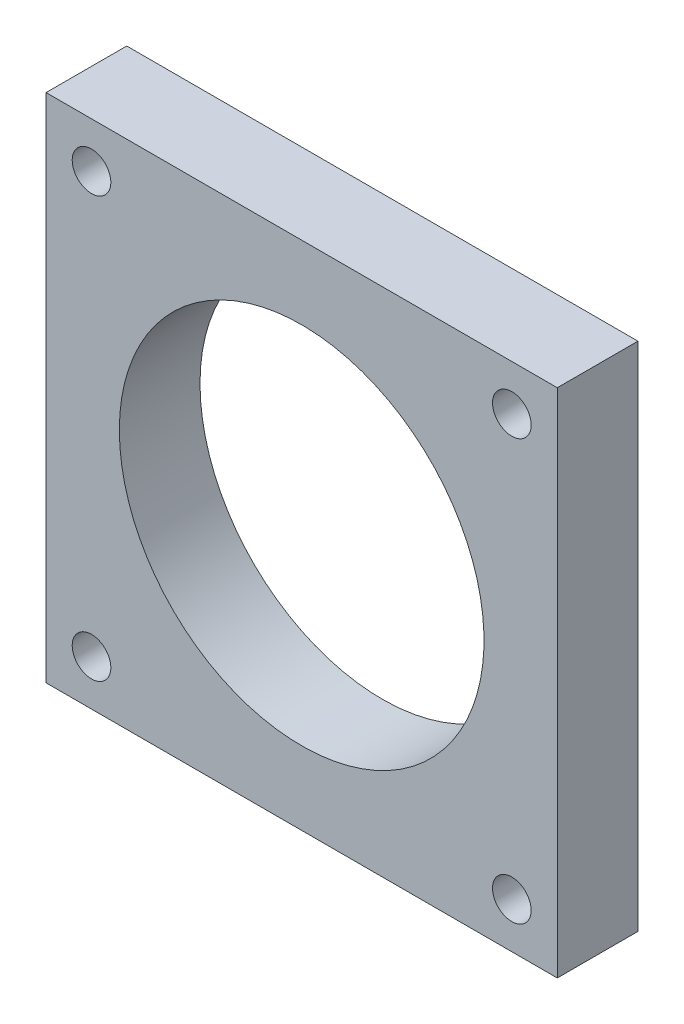
ISO-10303-21;
HEADER;
FILE_DESCRIPTION(('STEP AP214'),'2;1');
FILE_NAME('part.step','',(''),(''),'','','');
FILE_SCHEMA(('AUTOMOTIVE_DESIGN { 1 0 10303 214 1 1 1 1 }'));
ENDSEC;
DATA;
#1=APPLICATION_CONTEXT('core data for automotive mechanical design processes');
#2=APPLICATION_PROTOCOL_DEFINITION('international standard','automotive_design',2000,#1);
#3=PRODUCT_CONTEXT('',#1,'mechanical');
#4=PRODUCT('Part','Part','',(#3));
#5=PRODUCT_RELATED_PRODUCT_CATEGORY('part','',(#4));
#6=PRODUCT_DEFINITION_FORMATION('','',#4);
#7=PRODUCT_DEFINITION_CONTEXT('part definition',#1,'design');
#8=PRODUCT_DEFINITION('design','',#6,#7);
#9=PRODUCT_DEFINITION_SHAPE('','',#8);
#10=(LENGTH_UNIT() NAMED_UNIT(*) SI_UNIT(.MILLI.,.METRE.));
#11=(NAMED_UNIT(*) PLANE_ANGLE_UNIT() SI_UNIT($,.RADIAN.));
#12=(NAMED_UNIT(*) SI_UNIT($,.STERADIAN.) SOLID_ANGLE_UNIT());
#13=UNCERTAINTY_MEASURE_WITH_UNIT(LENGTH_MEASURE(1.E-05),#10,'distance_accuracy_value','');
#14=(GEOMETRIC_REPRESENTATION_CONTEXT(3) GLOBAL_UNCERTAINTY_ASSIGNED_CONTEXT((#13)) GLOBAL_UNIT_ASSIGNED_CONTEXT((#10,
#11,#12)) REPRESENTATION_CONTEXT('',''));
#15=CARTESIAN_POINT('',(0.,0.,0.));
#16=DIRECTION('',(0.,0.,1.));
#17=DIRECTION('',(1.,0.,0.));
#18=AXIS2_PLACEMENT_3D('',#15,#16,#17);
#19=CARTESIAN_POINT('',(0.,0.,7.1));
#20=DIRECTION('',(0.,0.,-1.));
#21=DIRECTION('',(-1.,0.,0.));
#22=AXIS2_PLACEMENT_3D('',#19,#20,#21);
#23=PLANE('',#22);
#24=CARTESIAN_POINT('',(18.5,18.5,7.1));
#25=DIRECTION('',(0.,0.,-1.));
#26=DIRECTION('',(-1.,0.,0.));
#27=AXIS2_PLACEMENT_3D('',#24,#25,#26);
#28=CIRCLE('',#27,1.7);
#29=CARTESIAN_POINT('',(16.8,18.5,7.1));
#30=VERTEX_POINT('',#29);
#31=EDGE_CURVE('E234',#30,#30,#28,.F.);
#32=ORIENTED_EDGE('',*,*,#31,.F.);
#33=EDGE_LOOP('',(#32));
#34=FACE_BOUND('',#33,.T.);
#35=CARTESIAN_POINT('',(-18.5,18.5,7.1));
#36=DIRECTION('',(0.,0.,-1.));
#37=DIRECTION('',(-1.,0.,0.));
#38=AXIS2_PLACEMENT_3D('',#35,#36,#37);
#39=CIRCLE('',#38,1.7);
#40=CARTESIAN_POINT('',(-20.2,18.5,7.1));
#41=VERTEX_POINT('',#40);
#42=EDGE_CURVE('E238',#41,#41,#39,.F.);
#43=ORIENTED_EDGE('',*,*,#42,.F.);
#44=EDGE_LOOP('',(#43));
#45=FACE_BOUND('',#44,.T.);
#46=CARTESIAN_POINT('',(-18.5,-18.5,7.1));
#47=DIRECTION('',(0.,0.,-1.));
#48=DIRECTION('',(-1.,0.,0.));
#49=AXIS2_PLACEMENT_3D('',#46,#47,#48);
#50=CIRCLE('',#49,1.7);
#51=CARTESIAN_POINT('',(-20.2,-18.5,7.1));
#52=VERTEX_POINT('',#51);
#53=EDGE_CURVE('E142',#52,#52,#50,.F.);
#54=ORIENTED_EDGE('',*,*,#53,.F.);
#55=EDGE_LOOP('',(#54));
#56=FACE_BOUND('',#55,.T.);
#57=CARTESIAN_POINT('',(18.5,-18.5,7.1));
#58=DIRECTION('',(0.,0.,-1.));
#59=DIRECTION('',(-1.,0.,0.));
#60=AXIS2_PLACEMENT_3D('',#57,#58,#59);
#61=CIRCLE('',#60,1.7);
#62=CARTESIAN_POINT('',(16.8,-18.5,7.1));
#63=VERTEX_POINT('',#62);
#64=EDGE_CURVE('E124',#63,#63,#61,.F.);
#65=ORIENTED_EDGE('',*,*,#64,.F.);
#66=EDGE_LOOP('',(#65));
#67=FACE_BOUND('',#66,.T.);
#68=DIRECTION('',(0.,1.,0.));
#69=VECTOR('',#68,1.);
#70=CARTESIAN_POINT('',(22.5,-22.5,7.1));
#71=LINE('',#70,#69);
#72=CARTESIAN_POINT('',(22.5,-22.5,7.1));
#73=VERTEX_POINT('',#72);
#74=CARTESIAN_POINT('',(22.5,22.5,7.1));
#75=VERTEX_POINT('',#74);
#76=EDGE_CURVE('E99',#73,#75,#71,.T.);
#77=ORIENTED_EDGE('',*,*,#76,.T.);
#78=DIRECTION('',(-1.,0.,0.));
#79=VECTOR('',#78,1.);
#80=CARTESIAN_POINT('',(-22.5,22.5,7.1));
#81=LINE('',#80,#79);
#82=CARTESIAN_POINT('',(-22.5,22.5,7.1));
#83=VERTEX_POINT('',#82);
#84=EDGE_CURVE('E94',#75,#83,#81,.T.);
#85=ORIENTED_EDGE('',*,*,#84,.T.);
#86=DIRECTION('',(0.,-1.,0.));
#87=VECTOR('',#86,1.);
#88=CARTESIAN_POINT('',(-22.5,-22.5,7.1));
#89=LINE('',#88,#87);
#90=CARTESIAN_POINT('',(-22.5,-22.5,7.1));
#91=VERTEX_POINT('',#90);
#92=EDGE_CURVE('E97',#83,#91,#89,.T.);
#93=ORIENTED_EDGE('',*,*,#92,.T.);
#94=DIRECTION('',(1.,0.,0.));
#95=VECTOR('',#94,1.);
#96=CARTESIAN_POINT('',(-22.5,-22.5,7.1));
#97=LINE('',#96,#95);
#98=EDGE_CURVE('E64',#91,#73,#97,.T.);
#99=ORIENTED_EDGE('',*,*,#98,.T.);
#100=EDGE_LOOP('',(#77,#85,#93,#99));
#101=FACE_BOUND('',#100,.T.);
#102=CARTESIAN_POINT('',(0.,0.,7.1));
#103=DIRECTION('',(0.,0.,-1.));
#104=DIRECTION('',(-1.,0.,0.));
#105=AXIS2_PLACEMENT_3D('',#102,#103,#104);
#106=CIRCLE('',#105,16.05);
#107=CARTESIAN_POINT('',(-16.05,0.,7.1));
#108=VERTEX_POINT('',#107);
#109=EDGE_CURVE('E115',#108,#108,#106,.F.);
#110=ORIENTED_EDGE('',*,*,#109,.F.);
#111=EDGE_LOOP('',(#110));
#112=FACE_BOUND('',#111,.T.);
#113=ADVANCED_FACE('F45',(#34,#45,#56,#67,#101,#112),#23,.F.);
#114=CARTESIAN_POINT('',(0.,0.,0.));
#115=DIRECTION('',(0.,0.,-1.));
#116=DIRECTION('',(-1.,0.,0.));
#117=AXIS2_PLACEMENT_3D('',#114,#115,#116);
#118=PLANE('',#117);
#119=CARTESIAN_POINT('',(18.5,18.5,0.));
#120=DIRECTION('',(0.,0.,-1.));
#121=DIRECTION('',(-1.,0.,0.));
#122=AXIS2_PLACEMENT_3D('',#119,#120,#121);
#123=CIRCLE('',#122,3.25);
#124=CARTESIAN_POINT('',(15.25,18.5,0.));
#125=VERTEX_POINT('',#124);
#126=EDGE_CURVE('E229',#125,#125,#123,.T.);
#127=ORIENTED_EDGE('',*,*,#126,.F.);
#128=EDGE_LOOP('',(#127));
#129=FACE_BOUND('',#128,.T.);
#130=CARTESIAN_POINT('',(-18.5,18.5,0.));
#131=DIRECTION('',(0.,0.,-1.));
#132=DIRECTION('',(-1.,0.,0.));
#133=AXIS2_PLACEMENT_3D('',#130,#131,#132);
#134=CIRCLE('',#133,3.25);
#135=CARTESIAN_POINT('',(-21.75,18.5,0.));
#136=VERTEX_POINT('',#135);
#137=EDGE_CURVE('E243',#136,#136,#134,.T.);
#138=ORIENTED_EDGE('',*,*,#137,.F.);
#139=EDGE_LOOP('',(#138));
#140=FACE_BOUND('',#139,.T.);
#141=CARTESIAN_POINT('',(-18.5,-18.5,0.));
#142=DIRECTION('',(0.,0.,-1.));
#143=DIRECTION('',(-1.,0.,0.));
#144=AXIS2_PLACEMENT_3D('',#141,#142,#143);
#145=CIRCLE('',#144,3.25);
#146=CARTESIAN_POINT('',(-21.75,-18.5,0.));
#147=VERTEX_POINT('',#146);
#148=EDGE_CURVE('E241',#147,#147,#145,.T.);
#149=ORIENTED_EDGE('',*,*,#148,.F.);
#150=EDGE_LOOP('',(#149));
#151=FACE_BOUND('',#150,.T.);
#152=CARTESIAN_POINT('',(18.5,-18.5,0.));
#153=DIRECTION('',(0.,0.,-1.));
#154=DIRECTION('',(-1.,0.,0.));
#155=AXIS2_PLACEMENT_3D('',#152,#153,#154);
#156=CIRCLE('',#155,3.25);
#157=CARTESIAN_POINT('',(15.25,-18.5,0.));
#158=VERTEX_POINT('',#157);
#159=EDGE_CURVE('E139',#158,#158,#156,.T.);
#160=ORIENTED_EDGE('',*,*,#159,.F.);
#161=EDGE_LOOP('',(#160));
#162=FACE_BOUND('',#161,.T.);
#163=DIRECTION('',(0.,1.,0.));
#164=VECTOR('',#163,1.);
#165=CARTESIAN_POINT('',(22.5,-22.5,0.));
#166=LINE('',#165,#164);
#167=CARTESIAN_POINT('',(22.5,-22.5,0.));
#168=VERTEX_POINT('',#167);
#169=CARTESIAN_POINT('',(22.5,22.5,0.));
#170=VERTEX_POINT('',#169);
#171=EDGE_CURVE('E112',#168,#170,#166,.T.);
#172=ORIENTED_EDGE('',*,*,#171,.F.);
#173=DIRECTION('',(1.,0.,0.));
#174=VECTOR('',#173,1.);
#175=CARTESIAN_POINT('',(-22.5,-22.5,0.));
#176=LINE('',#175,#174);
#177=CARTESIAN_POINT('',(-22.5,-22.5,0.));
#178=VERTEX_POINT('',#177);
#179=EDGE_CURVE('E87',#178,#168,#176,.T.);
#180=ORIENTED_EDGE('',*,*,#179,.F.);
#181=DIRECTION('',(0.,-1.,0.));
#182=VECTOR('',#181,1.);
#183=CARTESIAN_POINT('',(-22.5,-22.5,0.));
#184=LINE('',#183,#182);
#185=CARTESIAN_POINT('',(-22.5,22.5,0.));
#186=VERTEX_POINT('',#185);
#187=EDGE_CURVE('E81',#186,#178,#184,.T.);
#188=ORIENTED_EDGE('',*,*,#187,.F.);
#189=DIRECTION('',(-1.,0.,0.));
#190=VECTOR('',#189,1.);
#191=CARTESIAN_POINT('',(-22.5,22.5,0.));
#192=LINE('',#191,#190);
#193=EDGE_CURVE('E103',#170,#186,#192,.T.);
#194=ORIENTED_EDGE('',*,*,#193,.F.);
#195=EDGE_LOOP('',(#172,#180,#188,#194));
#196=FACE_BOUND('',#195,.T.);
#197=CARTESIAN_POINT('',(0.,0.,0.));
#198=DIRECTION('',(0.,0.,-1.));
#199=DIRECTION('',(-1.,0.,0.));
#200=AXIS2_PLACEMENT_3D('',#197,#198,#199);
#201=CIRCLE('',#200,16.05);
#202=CARTESIAN_POINT('',(-16.05,0.,0.));
#203=VERTEX_POINT('',#202);
#204=EDGE_CURVE('E49',#203,#203,#201,.F.);
#205=ORIENTED_EDGE('',*,*,#204,.T.);
#206=EDGE_LOOP('',(#205));
#207=FACE_BOUND('',#206,.T.);
#208=ADVANCED_FACE('F155',(#129,#140,#151,#162,#196,#207),#118,.T.);
#209=CARTESIAN_POINT('',(22.5,-22.5,7.1));
#210=DIRECTION('',(-1.,0.,0.));
#211=DIRECTION('',(0.,0.,1.));
#212=AXIS2_PLACEMENT_3D('',#209,#210,#211);
#213=PLANE('',#212);
#214=ORIENTED_EDGE('',*,*,#171,.T.);
#215=DIRECTION('',(0.,0.,-1.));
#216=VECTOR('',#215,1.);
#217=CARTESIAN_POINT('',(22.5,22.5,7.1));
#218=LINE('',#217,#216);
#219=EDGE_CURVE('E12',#75,#170,#218,.T.);
#220=ORIENTED_EDGE('',*,*,#219,.F.);
#221=ORIENTED_EDGE('',*,*,#76,.F.);
#222=DIRECTION('',(0.,0.,-1.));
#223=VECTOR('',#222,1.);
#224=CARTESIAN_POINT('',(22.5,-22.5,7.1));
#225=LINE('',#224,#223);
#226=EDGE_CURVE('E108',#73,#168,#225,.T.);
#227=ORIENTED_EDGE('',*,*,#226,.T.);
#228=EDGE_LOOP('',(#214,#220,#221,#227));
#229=FACE_BOUND('',#228,.T.);
#230=ADVANCED_FACE('F158',(#229),#213,.F.);
#231=CARTESIAN_POINT('',(-22.5,22.5,7.1));
#232=DIRECTION('',(0.,-1.,0.));
#233=DIRECTION('',(0.,0.,-1.));
#234=AXIS2_PLACEMENT_3D('',#231,#232,#233);
#235=PLANE('',#234);
#236=ORIENTED_EDGE('',*,*,#193,.T.);
#237=DIRECTION('',(0.,0.,-1.));
#238=VECTOR('',#237,1.);
#239=CARTESIAN_POINT('',(-22.5,22.5,7.1));
#240=LINE('',#239,#238);
#241=EDGE_CURVE('E55',#83,#186,#240,.T.);
#242=ORIENTED_EDGE('',*,*,#241,.F.);
#243=ORIENTED_EDGE('',*,*,#84,.F.);
#244=ORIENTED_EDGE('',*,*,#219,.T.);
#245=EDGE_LOOP('',(#236,#242,#243,#244));
#246=FACE_BOUND('',#245,.T.);
#247=ADVANCED_FACE('F102',(#246),#235,.F.);
#248=CARTESIAN_POINT('',(-22.5,-22.5,7.1));
#249=DIRECTION('',(1.,0.,0.));
#250=DIRECTION('',(0.,0.,-1.));
#251=AXIS2_PLACEMENT_3D('',#248,#249,#250);
#252=PLANE('',#251);
#253=ORIENTED_EDGE('',*,*,#187,.T.);
#254=DIRECTION('',(0.,0.,-1.));
#255=VECTOR('',#254,1.);
#256=CARTESIAN_POINT('',(-22.5,-22.5,7.1));
#257=LINE('',#256,#255);
#258=EDGE_CURVE('E104',#91,#178,#257,.T.);
#259=ORIENTED_EDGE('',*,*,#258,.F.);
#260=ORIENTED_EDGE('',*,*,#92,.F.);
#261=ORIENTED_EDGE('',*,*,#241,.T.);
#262=EDGE_LOOP('',(#253,#259,#260,#261));
#263=FACE_BOUND('',#262,.T.);
#264=ADVANCED_FACE('F106',(#263),#252,.F.);
#265=CARTESIAN_POINT('',(-22.5,-22.5,7.1));
#266=DIRECTION('',(0.,1.,0.));
#267=DIRECTION('',(0.,0.,1.));
#268=AXIS2_PLACEMENT_3D('',#265,#266,#267);
#269=PLANE('',#268);
#270=ORIENTED_EDGE('',*,*,#179,.T.);
#271=ORIENTED_EDGE('',*,*,#226,.F.);
#272=ORIENTED_EDGE('',*,*,#98,.F.);
#273=ORIENTED_EDGE('',*,*,#258,.T.);
#274=EDGE_LOOP('',(#270,#271,#272,#273));
#275=FACE_BOUND('',#274,.T.);
#276=ADVANCED_FACE('F163',(#275),#269,.F.);
#277=CARTESIAN_POINT('',(0.,0.,7.1));
#278=DIRECTION('',(0.,0.,-1.));
#279=DIRECTION('',(-1.,0.,0.));
#280=AXIS2_PLACEMENT_3D('',#277,#278,#279);
#281=CYLINDRICAL_SURFACE('',#280,16.05);
#282=ORIENTED_EDGE('',*,*,#109,.T.);
#283=EDGE_LOOP('',(#282));
#284=FACE_BOUND('',#283,.T.);
#285=ORIENTED_EDGE('',*,*,#204,.F.);
#286=EDGE_LOOP('',(#285));
#287=FACE_BOUND('',#286,.T.);
#288=ADVANCED_FACE('F47',(#284,#287),#281,.F.);
#289=CARTESIAN_POINT('',(18.5,-18.5,0.));
#290=DIRECTION('',(0.,0.,-1.));
#291=DIRECTION('',(-1.,0.,0.));
#292=AXIS2_PLACEMENT_3D('',#289,#290,#291);
#293=CYLINDRICAL_SURFACE('',#292,1.7);
#294=ORIENTED_EDGE('',*,*,#64,.T.);
#295=EDGE_LOOP('',(#294));
#296=FACE_BOUND('',#295,.T.);
#297=CARTESIAN_POINT('',(18.5,-18.5,3.));
#298=DIRECTION('',(0.,0.,-1.));
#299=DIRECTION('',(-1.,0.,0.));
#300=AXIS2_PLACEMENT_3D('',#297,#298,#299);
#301=CIRCLE('',#300,1.7);
#302=CARTESIAN_POINT('',(16.8,-18.5,3.));
#303=VERTEX_POINT('',#302);
#304=EDGE_CURVE('E128',#303,#303,#301,.T.);
#305=ORIENTED_EDGE('',*,*,#304,.T.);
#306=EDGE_LOOP('',(#305));
#307=FACE_BOUND('',#306,.T.);
#308=ADVANCED_FACE('F171',(#296,#307),#293,.F.);
#309=CARTESIAN_POINT('',(20.2,-18.5,3.));
#310=DIRECTION('',(0.,0.,1.));
#311=DIRECTION('',(1.,0.,0.));
#312=AXIS2_PLACEMENT_3D('',#309,#310,#311);
#313=PLANE('',#312);
#314=ORIENTED_EDGE('',*,*,#304,.F.);
#315=EDGE_LOOP('',(#314));
#316=FACE_BOUND('',#315,.T.);
#317=CARTESIAN_POINT('',(18.5,-18.5,3.));
#318=DIRECTION('',(0.,0.,-1.));
#319=DIRECTION('',(-1.,0.,0.));
#320=AXIS2_PLACEMENT_3D('',#317,#318,#319);
#321=CIRCLE('',#320,3.25);
#322=CARTESIAN_POINT('',(15.25,-18.5,3.));
#323=VERTEX_POINT('',#322);
#324=EDGE_CURVE('E133',#323,#323,#321,.T.);
#325=ORIENTED_EDGE('',*,*,#324,.T.);
#326=EDGE_LOOP('',(#325));
#327=FACE_BOUND('',#326,.T.);
#328=ADVANCED_FACE('F146',(#316,#327),#313,.F.);
#329=CARTESIAN_POINT('',(18.5,-18.5,0.));
#330=DIRECTION('',(0.,0.,-1.));
#331=DIRECTION('',(-1.,0.,0.));
#332=AXIS2_PLACEMENT_3D('',#329,#330,#331);
#333=CYLINDRICAL_SURFACE('',#332,3.25);
#334=ORIENTED_EDGE('',*,*,#324,.F.);
#335=EDGE_LOOP('',(#334));
#336=FACE_BOUND('',#335,.T.);
#337=ORIENTED_EDGE('',*,*,#159,.T.);
#338=EDGE_LOOP('',(#337));
#339=FACE_BOUND('',#338,.T.);
#340=ADVANCED_FACE('F148',(#336,#339),#333,.F.);
#341=CARTESIAN_POINT('',(-18.5,-18.5,0.));
#342=DIRECTION('',(0.,0.,-1.));
#343=DIRECTION('',(-1.,0.,0.));
#344=AXIS2_PLACEMENT_3D('',#341,#342,#343);
#345=CYLINDRICAL_SURFACE('',#344,1.7);
#346=ORIENTED_EDGE('',*,*,#53,.T.);
#347=EDGE_LOOP('',(#346));
#348=FACE_BOUND('',#347,.T.);
#349=CARTESIAN_POINT('',(-18.5,-18.5,3.));
#350=DIRECTION('',(0.,0.,-1.));
#351=DIRECTION('',(-1.,0.,0.));
#352=AXIS2_PLACEMENT_3D('',#349,#350,#351);
#353=CIRCLE('',#352,1.7);
#354=CARTESIAN_POINT('',(-20.2,-18.5,3.));
#355=VERTEX_POINT('',#354);
#356=EDGE_CURVE('E137',#355,#355,#353,.T.);
#357=ORIENTED_EDGE('',*,*,#356,.T.);
#358=EDGE_LOOP('',(#357));
#359=FACE_BOUND('',#358,.T.);
#360=ADVANCED_FACE('F151',(#348,#359),#345,.F.);
#361=CARTESIAN_POINT('',(-16.8,-18.5,3.));
#362=DIRECTION('',(0.,0.,1.));
#363=DIRECTION('',(1.,0.,0.));
#364=AXIS2_PLACEMENT_3D('',#361,#362,#363);
#365=PLANE('',#364);
#366=ORIENTED_EDGE('',*,*,#356,.F.);
#367=EDGE_LOOP('',(#366));
#368=FACE_BOUND('',#367,.T.);
#369=CARTESIAN_POINT('',(-18.5,-18.5,3.));
#370=DIRECTION('',(0.,0.,-1.));
#371=DIRECTION('',(-1.,0.,0.));
#372=AXIS2_PLACEMENT_3D('',#369,#370,#371);
#373=CIRCLE('',#372,3.25);
#374=CARTESIAN_POINT('',(-21.75,-18.5,3.));
#375=VERTEX_POINT('',#374);
#376=EDGE_CURVE('E254',#375,#375,#373,.T.);
#377=ORIENTED_EDGE('',*,*,#376,.T.);
#378=EDGE_LOOP('',(#377));
#379=FACE_BOUND('',#378,.T.);
#380=ADVANCED_FACE('F190',(#368,#379),#365,.F.);
#381=CARTESIAN_POINT('',(-18.5,-18.5,0.));
#382=DIRECTION('',(0.,0.,-1.));
#383=DIRECTION('',(-1.,0.,0.));
#384=AXIS2_PLACEMENT_3D('',#381,#382,#383);
#385=CYLINDRICAL_SURFACE('',#384,3.25);
#386=ORIENTED_EDGE('',*,*,#376,.F.);
#387=EDGE_LOOP('',(#386));
#388=FACE_BOUND('',#387,.T.);
#389=ORIENTED_EDGE('',*,*,#148,.T.);
#390=EDGE_LOOP('',(#389));
#391=FACE_BOUND('',#390,.T.);
#392=ADVANCED_FACE('F194',(#388,#391),#385,.F.);
#393=CARTESIAN_POINT('',(-18.5,18.5,0.));
#394=DIRECTION('',(0.,0.,-1.));
#395=DIRECTION('',(-1.,0.,0.));
#396=AXIS2_PLACEMENT_3D('',#393,#394,#395);
#397=CYLINDRICAL_SURFACE('',#396,1.7);
#398=ORIENTED_EDGE('',*,*,#42,.T.);
#399=EDGE_LOOP('',(#398));
#400=FACE_BOUND('',#399,.T.);
#401=CARTESIAN_POINT('',(-18.5,18.5,3.));
#402=DIRECTION('',(0.,0.,-1.));
#403=DIRECTION('',(-1.,0.,0.));
#404=AXIS2_PLACEMENT_3D('',#401,#402,#403);
#405=CIRCLE('',#404,1.7);
#406=CARTESIAN_POINT('',(-20.2,18.5,3.));
#407=VERTEX_POINT('',#406);
#408=EDGE_CURVE('E242',#407,#407,#405,.T.);
#409=ORIENTED_EDGE('',*,*,#408,.T.);
#410=EDGE_LOOP('',(#409));
#411=FACE_BOUND('',#410,.T.);
#412=ADVANCED_FACE('F198',(#400,#411),#397,.F.);
#413=CARTESIAN_POINT('',(-16.8,18.5,3.));
#414=DIRECTION('',(0.,0.,1.));
#415=DIRECTION('',(1.,0.,0.));
#416=AXIS2_PLACEMENT_3D('',#413,#414,#415);
#417=PLANE('',#416);
#418=ORIENTED_EDGE('',*,*,#408,.F.);
#419=EDGE_LOOP('',(#418));
#420=FACE_BOUND('',#419,.T.);
#421=CARTESIAN_POINT('',(-18.5,18.5,3.));
#422=DIRECTION('',(0.,0.,-1.));
#423=DIRECTION('',(-1.,0.,0.));
#424=AXIS2_PLACEMENT_3D('',#421,#422,#423);
#425=CIRCLE('',#424,3.25);
#426=CARTESIAN_POINT('',(-21.75,18.5,3.));
#427=VERTEX_POINT('',#426);
#428=EDGE_CURVE('E246',#427,#427,#425,.T.);
#429=ORIENTED_EDGE('',*,*,#428,.T.);
#430=EDGE_LOOP('',(#429));
#431=FACE_BOUND('',#430,.T.);
#432=ADVANCED_FACE('F202',(#420,#431),#417,.F.);
#433=CARTESIAN_POINT('',(-18.5,18.5,0.));
#434=DIRECTION('',(0.,0.,-1.));
#435=DIRECTION('',(-1.,0.,0.));
#436=AXIS2_PLACEMENT_3D('',#433,#434,#435);
#437=CYLINDRICAL_SURFACE('',#436,3.25);
#438=ORIENTED_EDGE('',*,*,#428,.F.);
#439=EDGE_LOOP('',(#438));
#440=FACE_BOUND('',#439,.T.);
#441=ORIENTED_EDGE('',*,*,#137,.T.);
#442=EDGE_LOOP('',(#441));
#443=FACE_BOUND('',#442,.T.);
#444=ADVANCED_FACE('F206',(#440,#443),#437,.F.);
#445=CARTESIAN_POINT('',(18.5,18.5,0.));
#446=DIRECTION('',(0.,0.,-1.));
#447=DIRECTION('',(-1.,0.,0.));
#448=AXIS2_PLACEMENT_3D('',#445,#446,#447);
#449=CYLINDRICAL_SURFACE('',#448,1.7);
#450=ORIENTED_EDGE('',*,*,#31,.T.);
#451=EDGE_LOOP('',(#450));
#452=FACE_BOUND('',#451,.T.);
#453=CARTESIAN_POINT('',(18.5,18.5,3.));
#454=DIRECTION('',(0.,0.,-1.));
#455=DIRECTION('',(-1.,0.,0.));
#456=AXIS2_PLACEMENT_3D('',#453,#454,#455);
#457=CIRCLE('',#456,1.7);
#458=CARTESIAN_POINT('',(16.8,18.5,3.));
#459=VERTEX_POINT('',#458);
#460=EDGE_CURVE('E231',#459,#459,#457,.T.);
#461=ORIENTED_EDGE('',*,*,#460,.T.);
#462=EDGE_LOOP('',(#461));
#463=FACE_BOUND('',#462,.T.);
#464=ADVANCED_FACE('F210',(#452,#463),#449,.F.);
#465=CARTESIAN_POINT('',(20.2,18.5,3.));
#466=DIRECTION('',(0.,0.,1.));
#467=DIRECTION('',(1.,0.,0.));
#468=AXIS2_PLACEMENT_3D('',#465,#466,#467);
#469=PLANE('',#468);
#470=ORIENTED_EDGE('',*,*,#460,.F.);
#471=EDGE_LOOP('',(#470));
#472=FACE_BOUND('',#471,.T.);
#473=CARTESIAN_POINT('',(18.5,18.5,3.));
#474=DIRECTION('',(0.,0.,-1.));
#475=DIRECTION('',(-1.,0.,0.));
#476=AXIS2_PLACEMENT_3D('',#473,#474,#475);
#477=CIRCLE('',#476,3.25);
#478=CARTESIAN_POINT('',(15.25,18.5,3.));
#479=VERTEX_POINT('',#478);
#480=EDGE_CURVE('E226',#479,#479,#477,.T.);
#481=ORIENTED_EDGE('',*,*,#480,.T.);
#482=EDGE_LOOP('',(#481));
#483=FACE_BOUND('',#482,.T.);
#484=ADVANCED_FACE('F214',(#472,#483),#469,.F.);
#485=CARTESIAN_POINT('',(18.5,18.5,0.));
#486=DIRECTION('',(0.,0.,-1.));
#487=DIRECTION('',(-1.,0.,0.));
#488=AXIS2_PLACEMENT_3D('',#485,#486,#487);
#489=CYLINDRICAL_SURFACE('',#488,3.25);
#490=ORIENTED_EDGE('',*,*,#480,.F.);
#491=EDGE_LOOP('',(#490));
#492=FACE_BOUND('',#491,.T.);
#493=ORIENTED_EDGE('',*,*,#126,.T.);
#494=EDGE_LOOP('',(#493));
#495=FACE_BOUND('',#494,.T.);
#496=ADVANCED_FACE('F218',(#492,#495),#489,.F.);
#497=CLOSED_SHELL('',(#113,#208,#230,#247,#264,#276,#288,#308,#328,#340,#360,#380,#392,#412,
#432,#444,#464,#484,#496));
#498=MANIFOLD_SOLID_BREP('B2',#497);
#499=ADVANCED_BREP_SHAPE_REPRESENTATION('',(#18,#498),#14);
#500=SHAPE_DEFINITION_REPRESENTATION(#9,#499);
ENDSEC;
END-ISO-10303-21;
